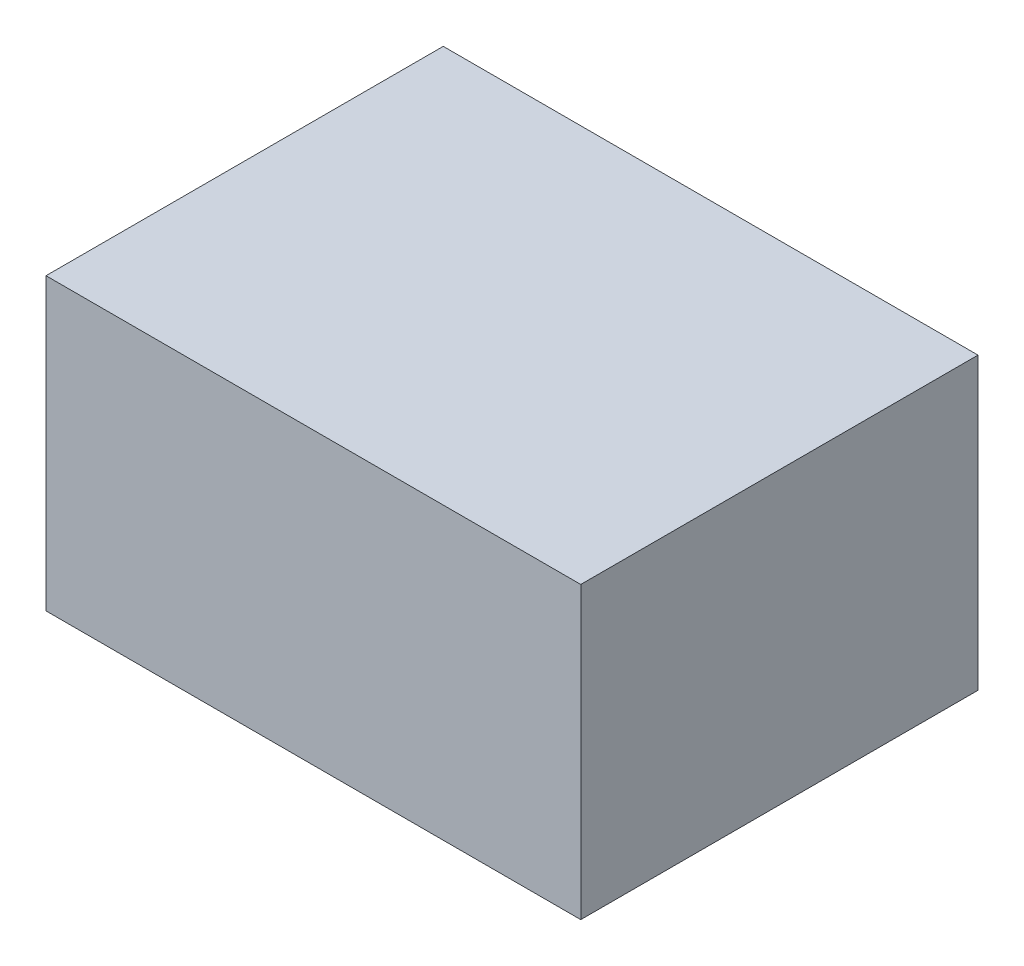
ISO-10303-21;
HEADER;
FILE_DESCRIPTION(('STEP AP214'),'2;1');
FILE_NAME('part.step','',(''),(''),'','','');
FILE_SCHEMA(('AUTOMOTIVE_DESIGN { 1 0 10303 214 1 1 1 1 }'));
ENDSEC;
DATA;
#1=APPLICATION_CONTEXT('core data for automotive mechanical design processes');
#2=APPLICATION_PROTOCOL_DEFINITION('international standard','automotive_design',2000,#1);
#3=PRODUCT_CONTEXT('',#1,'mechanical');
#4=PRODUCT('Part','Part','',(#3));
#5=PRODUCT_RELATED_PRODUCT_CATEGORY('part','',(#4));
#6=PRODUCT_DEFINITION_FORMATION('','',#4);
#7=PRODUCT_DEFINITION_CONTEXT('part definition',#1,'design');
#8=PRODUCT_DEFINITION('design','',#6,#7);
#9=PRODUCT_DEFINITION_SHAPE('','',#8);
#10=(LENGTH_UNIT() NAMED_UNIT(*) SI_UNIT(.MILLI.,.METRE.));
#11=(NAMED_UNIT(*) PLANE_ANGLE_UNIT() SI_UNIT($,.RADIAN.));
#12=(NAMED_UNIT(*) SI_UNIT($,.STERADIAN.) SOLID_ANGLE_UNIT());
#13=UNCERTAINTY_MEASURE_WITH_UNIT(LENGTH_MEASURE(1.E-05),#10,'distance_accuracy_value','');
#14=(GEOMETRIC_REPRESENTATION_CONTEXT(3) GLOBAL_UNCERTAINTY_ASSIGNED_CONTEXT((#13)) GLOBAL_UNIT_ASSIGNED_CONTEXT((#10,
#11,#12)) REPRESENTATION_CONTEXT('',''));
#15=CARTESIAN_POINT('',(0.,0.,0.));
#16=DIRECTION('',(0.,0.,1.));
#17=DIRECTION('',(1.,0.,0.));
#18=AXIS2_PLACEMENT_3D('',#15,#16,#17);
#19=CARTESIAN_POINT('',(-0.87499952,0.47500032,0.));
#20=DIRECTION('',(0.,1.,0.));
#21=DIRECTION('',(0.,0.,1.));
#22=AXIS2_PLACEMENT_3D('',#19,#20,#21);
#23=PLANE('',#22);
#24=DIRECTION('',(0.,0.,-1.));
#25=VECTOR('',#24,1.);
#26=CARTESIAN_POINT('',(0.87499952,0.47500032,0.));
#27=LINE('',#26,#25);
#28=CARTESIAN_POINT('',(0.87499952,0.47500032,0.));
#29=VERTEX_POINT('',#28);
#30=CARTESIAN_POINT('',(0.87499952,0.47500032,1.29999994));
#31=VERTEX_POINT('',#30);
#32=EDGE_CURVE('E19',#29,#31,#27,.F.);
#33=ORIENTED_EDGE('',*,*,#32,.F.);
#34=DIRECTION('',(1.,0.,0.));
#35=VECTOR('',#34,1.);
#36=CARTESIAN_POINT('',(0.87499952,0.47500032,0.));
#37=LINE('',#36,#35);
#38=CARTESIAN_POINT('',(-0.87499952,0.47500032,0.));
#39=VERTEX_POINT('',#38);
#40=EDGE_CURVE('E79',#29,#39,#37,.F.);
#41=ORIENTED_EDGE('',*,*,#40,.T.);
#42=DIRECTION('',(0.,0.,1.));
#43=VECTOR('',#42,1.);
#44=CARTESIAN_POINT('',(-0.87499952,0.47500032,0.));
#45=LINE('',#44,#43);
#46=CARTESIAN_POINT('',(-0.87499952,0.47500032,1.29999994));
#47=VERTEX_POINT('',#46);
#48=EDGE_CURVE('E67',#47,#39,#45,.F.);
#49=ORIENTED_EDGE('',*,*,#48,.F.);
#50=DIRECTION('',(1.,0.,0.));
#51=VECTOR('',#50,1.);
#52=CARTESIAN_POINT('',(0.87499952,0.47500032,1.29999994));
#53=LINE('',#52,#51);
#54=EDGE_CURVE('E55',#31,#47,#53,.F.);
#55=ORIENTED_EDGE('',*,*,#54,.F.);
#56=EDGE_LOOP('',(#33,#41,#49,#55));
#57=FACE_BOUND('',#56,.T.);
#58=ADVANCED_FACE('F16',(#57),#23,.T.);
#59=CARTESIAN_POINT('',(0.87499952,0.47500032,0.));
#60=DIRECTION('',(1.,0.,0.));
#61=DIRECTION('',(0.,0.,-1.));
#62=AXIS2_PLACEMENT_3D('',#59,#60,#61);
#63=PLANE('',#62);
#64=DIRECTION('',(0.,0.,-1.));
#65=VECTOR('',#64,1.);
#66=CARTESIAN_POINT('',(0.87499952,-0.47500032,0.));
#67=LINE('',#66,#65);
#68=CARTESIAN_POINT('',(0.87499952,-0.47500032,0.));
#69=VERTEX_POINT('',#68);
#70=CARTESIAN_POINT('',(0.87499952,-0.47500032,1.29999994));
#71=VERTEX_POINT('',#70);
#72=EDGE_CURVE('E82',#69,#71,#67,.F.);
#73=ORIENTED_EDGE('',*,*,#72,.F.);
#74=DIRECTION('',(0.,1.,0.));
#75=VECTOR('',#74,1.);
#76=CARTESIAN_POINT('',(0.87499952,-0.47500032,0.));
#77=LINE('',#76,#75);
#78=EDGE_CURVE('E64',#69,#29,#77,.T.);
#79=ORIENTED_EDGE('',*,*,#78,.T.);
#80=ORIENTED_EDGE('',*,*,#32,.T.);
#81=DIRECTION('',(0.,1.,0.));
#82=VECTOR('',#81,1.);
#83=CARTESIAN_POINT('',(0.87499952,-0.47500032,1.29999994));
#84=LINE('',#83,#82);
#85=EDGE_CURVE('E61',#71,#31,#84,.T.);
#86=ORIENTED_EDGE('',*,*,#85,.F.);
#87=EDGE_LOOP('',(#73,#79,#80,#86));
#88=FACE_BOUND('',#87,.T.);
#89=ADVANCED_FACE('F60',(#88),#63,.T.);
#90=CARTESIAN_POINT('',(0.87499952,-0.47500032,1.29999994));
#91=DIRECTION('',(0.,0.,1.));
#92=DIRECTION('',(1.,0.,0.));
#93=AXIS2_PLACEMENT_3D('',#90,#91,#92);
#94=PLANE('',#93);
#95=DIRECTION('',(0.,1.,0.));
#96=VECTOR('',#95,1.);
#97=CARTESIAN_POINT('',(-0.87499952,-0.47500032,1.29999994));
#98=LINE('',#97,#96);
#99=CARTESIAN_POINT('',(-0.87499952,-0.47500032,1.29999994));
#100=VERTEX_POINT('',#99);
#101=EDGE_CURVE('E69',#100,#47,#98,.T.);
#102=ORIENTED_EDGE('',*,*,#101,.F.);
#103=DIRECTION('',(1.,0.,0.));
#104=VECTOR('',#103,1.);
#105=CARTESIAN_POINT('',(0.87499952,-0.47500032,1.29999994));
#106=LINE('',#105,#104);
#107=EDGE_CURVE('E73',#71,#100,#106,.F.);
#108=ORIENTED_EDGE('',*,*,#107,.F.);
#109=ORIENTED_EDGE('',*,*,#85,.T.);
#110=ORIENTED_EDGE('',*,*,#54,.T.);
#111=EDGE_LOOP('',(#102,#108,#109,#110));
#112=FACE_BOUND('',#111,.T.);
#113=ADVANCED_FACE('F71',(#112),#94,.T.);
#114=CARTESIAN_POINT('',(-0.87499952,-0.47500032,0.));
#115=DIRECTION('',(-1.,0.,0.));
#116=DIRECTION('',(0.,0.,1.));
#117=AXIS2_PLACEMENT_3D('',#114,#115,#116);
#118=PLANE('',#117);
#119=ORIENTED_EDGE('',*,*,#48,.T.);
#120=DIRECTION('',(0.,1.,0.));
#121=VECTOR('',#120,1.);
#122=CARTESIAN_POINT('',(-0.87499952,-0.47500032,0.));
#123=LINE('',#122,#121);
#124=CARTESIAN_POINT('',(-0.87499952,-0.47500032,0.));
#125=VERTEX_POINT('',#124);
#126=EDGE_CURVE('E34',#39,#125,#123,.F.);
#127=ORIENTED_EDGE('',*,*,#126,.T.);
#128=DIRECTION('',(0.,0.,-1.));
#129=VECTOR('',#128,1.);
#130=CARTESIAN_POINT('',(-0.87499952,-0.47500032,0.));
#131=LINE('',#130,#129);
#132=EDGE_CURVE('E25',#100,#125,#131,.T.);
#133=ORIENTED_EDGE('',*,*,#132,.F.);
#134=ORIENTED_EDGE('',*,*,#101,.T.);
#135=EDGE_LOOP('',(#119,#127,#133,#134));
#136=FACE_BOUND('',#135,.T.);
#137=ADVANCED_FACE('F88',(#136),#118,.T.);
#138=CARTESIAN_POINT('',(0.87499952,-0.47500032,0.));
#139=DIRECTION('',(0.,0.,1.));
#140=DIRECTION('',(1.,0.,0.));
#141=AXIS2_PLACEMENT_3D('',#138,#139,#140);
#142=PLANE('',#141);
#143=ORIENTED_EDGE('',*,*,#126,.F.);
#144=ORIENTED_EDGE('',*,*,#40,.F.);
#145=ORIENTED_EDGE('',*,*,#78,.F.);
#146=DIRECTION('',(1.,0.,0.));
#147=VECTOR('',#146,1.);
#148=CARTESIAN_POINT('',(0.87499952,-0.47500032,0.));
#149=LINE('',#148,#147);
#150=EDGE_CURVE('E10',#125,#69,#149,.T.);
#151=ORIENTED_EDGE('',*,*,#150,.F.);
#152=EDGE_LOOP('',(#143,#144,#145,#151));
#153=FACE_BOUND('',#152,.T.);
#154=ADVANCED_FACE('F90',(#153),#142,.F.);
#155=CARTESIAN_POINT('',(0.87499952,-0.47500032,0.));
#156=DIRECTION('',(0.,-1.,0.));
#157=DIRECTION('',(0.,0.,-1.));
#158=AXIS2_PLACEMENT_3D('',#155,#156,#157);
#159=PLANE('',#158);
#160=ORIENTED_EDGE('',*,*,#132,.T.);
#161=ORIENTED_EDGE('',*,*,#150,.T.);
#162=ORIENTED_EDGE('',*,*,#72,.T.);
#163=ORIENTED_EDGE('',*,*,#107,.T.);
#164=EDGE_LOOP('',(#160,#161,#162,#163));
#165=FACE_BOUND('',#164,.T.);
#166=ADVANCED_FACE('F87',(#165),#159,.T.);
#167=CLOSED_SHELL('',(#58,#89,#113,#137,#154,#166));
#168=MANIFOLD_SOLID_BREP('B1',#167);
#169=ADVANCED_BREP_SHAPE_REPRESENTATION('',(#18,#168),#14);
#170=SHAPE_DEFINITION_REPRESENTATION(#9,#169);
ENDSEC;
END-ISO-10303-21;
